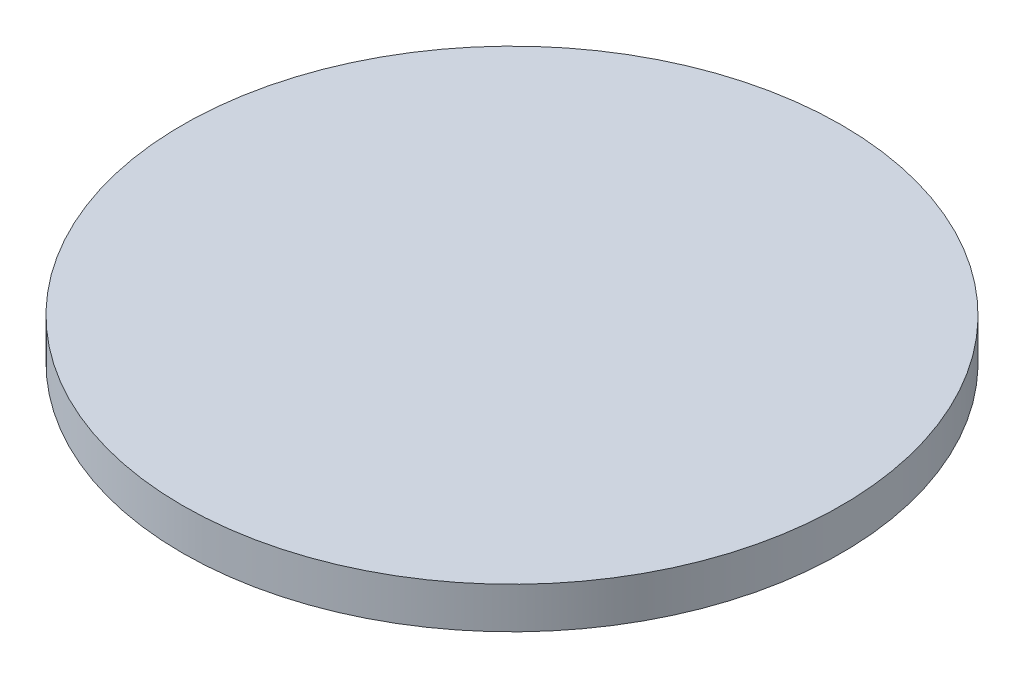
ISO-10303-21;
HEADER;
FILE_DESCRIPTION(('STEP AP214'),'2;1');
FILE_NAME('part.step','',(''),(''),'','','');
FILE_SCHEMA(('AUTOMOTIVE_DESIGN { 1 0 10303 214 1 1 1 1 }'));
ENDSEC;
DATA;
#1=APPLICATION_CONTEXT('core data for automotive mechanical design processes');
#2=APPLICATION_PROTOCOL_DEFINITION('international standard','automotive_design',2000,#1);
#3=PRODUCT_CONTEXT('',#1,'mechanical');
#4=PRODUCT('Part','Part','',(#3));
#5=PRODUCT_RELATED_PRODUCT_CATEGORY('part','',(#4));
#6=PRODUCT_DEFINITION_FORMATION('','',#4);
#7=PRODUCT_DEFINITION_CONTEXT('part definition',#1,'design');
#8=PRODUCT_DEFINITION('design','',#6,#7);
#9=PRODUCT_DEFINITION_SHAPE('','',#8);
#10=(LENGTH_UNIT() NAMED_UNIT(*) SI_UNIT(.MILLI.,.METRE.));
#11=(NAMED_UNIT(*) PLANE_ANGLE_UNIT() SI_UNIT($,.RADIAN.));
#12=(NAMED_UNIT(*) SI_UNIT($,.STERADIAN.) SOLID_ANGLE_UNIT());
#13=UNCERTAINTY_MEASURE_WITH_UNIT(LENGTH_MEASURE(1.E-05),#10,'distance_accuracy_value','');
#14=(GEOMETRIC_REPRESENTATION_CONTEXT(3) GLOBAL_UNCERTAINTY_ASSIGNED_CONTEXT((#13)) GLOBAL_UNIT_ASSIGNED_CONTEXT((#10,
#11,#12)) REPRESENTATION_CONTEXT('',''));
#15=CARTESIAN_POINT('',(0.,0.,0.));
#16=DIRECTION('',(0.,0.,1.));
#17=DIRECTION('',(1.,0.,0.));
#18=AXIS2_PLACEMENT_3D('',#15,#16,#17);
#19=CARTESIAN_POINT('',(0.,19.05,0.));
#20=DIRECTION('',(0.,-1.,0.));
#21=DIRECTION('',(0.,0.,-1.));
#22=AXIS2_PLACEMENT_3D('',#19,#20,#21);
#23=CYLINDRICAL_SURFACE('',#22,152.4);
#24=CARTESIAN_POINT('',(0.,19.05,0.));
#25=DIRECTION('',(0.,1.,0.));
#26=DIRECTION('',(0.,0.,1.));
#27=AXIS2_PLACEMENT_3D('',#24,#25,#26);
#28=CIRCLE('',#27,152.4);
#29=CARTESIAN_POINT('',(0.,19.05,152.4));
#30=VERTEX_POINT('',#29);
#31=EDGE_CURVE('E10',#30,#30,#28,.T.);
#32=ORIENTED_EDGE('',*,*,#31,.F.);
#33=EDGE_LOOP('',(#32));
#34=FACE_BOUND('',#33,.T.);
#35=CARTESIAN_POINT('',(0.,0.,0.));
#36=DIRECTION('',(0.,1.,0.));
#37=DIRECTION('',(0.,0.,1.));
#38=AXIS2_PLACEMENT_3D('',#35,#36,#37);
#39=CIRCLE('',#38,152.4);
#40=CARTESIAN_POINT('',(0.,0.,152.4));
#41=VERTEX_POINT('',#40);
#42=EDGE_CURVE('E37',#41,#41,#39,.T.);
#43=ORIENTED_EDGE('',*,*,#42,.T.);
#44=EDGE_LOOP('',(#43));
#45=FACE_BOUND('',#44,.T.);
#46=ADVANCED_FACE('F34',(#34,#45),#23,.T.);
#47=CARTESIAN_POINT('',(0.,19.05,0.));
#48=DIRECTION('',(0.,1.,0.));
#49=DIRECTION('',(0.,0.,1.));
#50=AXIS2_PLACEMENT_3D('',#47,#48,#49);
#51=PLANE('',#50);
#52=ORIENTED_EDGE('',*,*,#31,.T.);
#53=EDGE_LOOP('',(#52));
#54=FACE_BOUND('',#53,.T.);
#55=ADVANCED_FACE('F49',(#54),#51,.T.);
#56=CARTESIAN_POINT('',(0.,0.,0.));
#57=DIRECTION('',(0.,1.,0.));
#58=DIRECTION('',(0.,0.,1.));
#59=AXIS2_PLACEMENT_3D('',#56,#57,#58);
#60=PLANE('',#59);
#61=ORIENTED_EDGE('',*,*,#42,.F.);
#62=EDGE_LOOP('',(#61));
#63=FACE_BOUND('',#62,.T.);
#64=ADVANCED_FACE('F47',(#63),#60,.F.);
#65=CLOSED_SHELL('',(#46,#55,#64));
#66=MANIFOLD_SOLID_BREP('B2',#65);
#67=ADVANCED_BREP_SHAPE_REPRESENTATION('',(#18,#66),#14);
#68=SHAPE_DEFINITION_REPRESENTATION(#9,#67);
ENDSEC;
END-ISO-10303-21;
